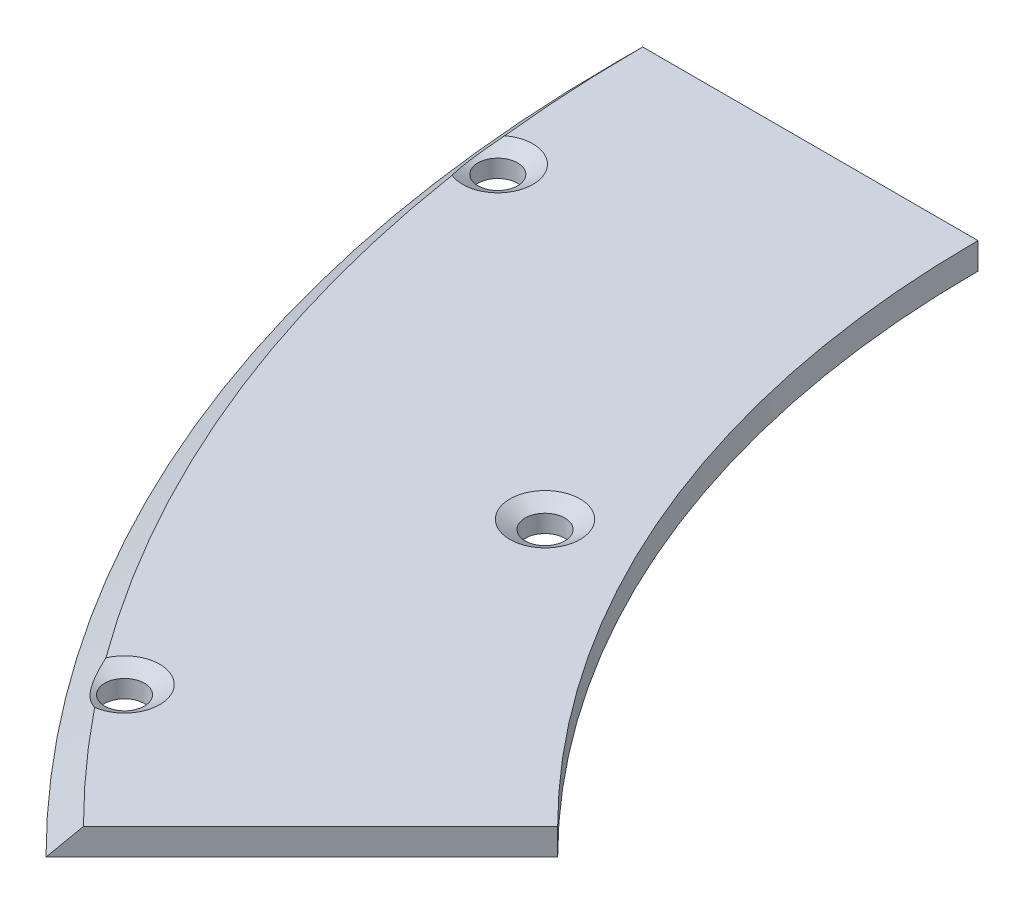
ISO-10303-21;
HEADER;
FILE_DESCRIPTION(('STEP AP214'),'2;1');
FILE_NAME('part.step','',(''),(''),'','','');
FILE_SCHEMA(('AUTOMOTIVE_DESIGN { 1 0 10303 214 1 1 1 1 }'));
ENDSEC;
DATA;
#1=APPLICATION_CONTEXT('core data for automotive mechanical design processes');
#2=APPLICATION_PROTOCOL_DEFINITION('international standard','automotive_design',2000,#1);
#3=PRODUCT_CONTEXT('',#1,'mechanical');
#4=PRODUCT('Part','Part','',(#3));
#5=PRODUCT_RELATED_PRODUCT_CATEGORY('part','',(#4));
#6=PRODUCT_DEFINITION_FORMATION('','',#4);
#7=PRODUCT_DEFINITION_CONTEXT('part definition',#1,'design');
#8=PRODUCT_DEFINITION('design','',#6,#7);
#9=PRODUCT_DEFINITION_SHAPE('','',#8);
#10=(LENGTH_UNIT() NAMED_UNIT(*) SI_UNIT(.MILLI.,.METRE.));
#11=(NAMED_UNIT(*) PLANE_ANGLE_UNIT() SI_UNIT($,.RADIAN.));
#12=(NAMED_UNIT(*) SI_UNIT($,.STERADIAN.) SOLID_ANGLE_UNIT());
#13=UNCERTAINTY_MEASURE_WITH_UNIT(LENGTH_MEASURE(1.E-05),#10,'distance_accuracy_value','');
#14=(GEOMETRIC_REPRESENTATION_CONTEXT(3) GLOBAL_UNCERTAINTY_ASSIGNED_CONTEXT((#13)) GLOBAL_UNIT_ASSIGNED_CONTEXT((#10,
#11,#12)) REPRESENTATION_CONTEXT('',''));
#15=CARTESIAN_POINT('',(0.,0.,0.));
#16=DIRECTION('',(0.,0.,1.));
#17=DIRECTION('',(1.,0.,0.));
#18=AXIS2_PLACEMENT_3D('',#15,#16,#17);
#19=CARTESIAN_POINT('',(0.,3.,0.));
#20=DIRECTION('',(0.,1.,0.));
#21=DIRECTION('',(0.,0.,1.));
#22=AXIS2_PLACEMENT_3D('',#19,#20,#21);
#23=PLANE('',#22);
#24=CARTESIAN_POINT('',(-112.185705103319,3.,51.8808015596447));
#25=DIRECTION('',(0.,1.,0.));
#26=DIRECTION('',(0.,0.,1.));
#27=AXIS2_PLACEMENT_3D('',#24,#25,#26);
#28=CIRCLE('',#27,3.98205080756883);
#29=CARTESIAN_POINT('',(-112.185705103319,3.,55.8628523672136));
#30=VERTEX_POINT('',#29);
#31=EDGE_CURVE('E11',#30,#30,#28,.F.);
#32=ORIENTED_EDGE('',*,*,#31,.T.);
#33=EDGE_LOOP('',(#32));
#34=FACE_BOUND('',#33,.T.);
#35=DIRECTION('',(-1.,0.,0.));
#36=VECTOR('',#35,1.);
#37=CARTESIAN_POINT('',(-115.,3.,0.));
#38=LINE('',#37,#36);
#39=CARTESIAN_POINT('',(-115.,3.,0.));
#40=VERTEX_POINT('',#39);
#41=CARTESIAN_POINT('',(-153.,3.,0.));
#42=VERTEX_POINT('',#41);
#43=EDGE_CURVE('E84',#40,#42,#38,.T.);
#44=ORIENTED_EDGE('',*,*,#43,.T.);
#45=CARTESIAN_POINT('',(0.,3.,0.));
#46=DIRECTION('',(0.,1.,0.));
#47=DIRECTION('',(0.,0.,1.));
#48=AXIS2_PLACEMENT_3D('',#45,#46,#47);
#49=CIRCLE('',#48,153.);
#50=CARTESIAN_POINT('',(-152.10452532569,3.,16.5291674154085));
#51=VERTEX_POINT('',#50);
#52=EDGE_CURVE('E123',#42,#51,#49,.T.);
#53=ORIENTED_EDGE('',*,*,#52,.T.);
#54=CARTESIAN_POINT('',(-149.708174067445,3.,19.7094550252278));
#55=DIRECTION('',(0.,1.,0.));
#56=DIRECTION('',(0.,0.,1.));
#57=AXIS2_PLACEMENT_3D('',#54,#55,#56);
#58=CIRCLE('',#57,3.98205080756889);
#59=CARTESIAN_POINT('',(-151.199752634319,3.,23.4015983069685));
#60=VERTEX_POINT('',#59);
#61=EDGE_CURVE('E108',#51,#60,#58,.F.);
#62=ORIENTED_EDGE('',*,*,#61,.T.);
#63=CARTESIAN_POINT('',(0.,3.,0.));
#64=DIRECTION('',(0.,1.,0.));
#65=DIRECTION('',(0.,0.,1.));
#66=AXIS2_PLACEMENT_3D('',#63,#64,#65);
#67=CIRCLE('',#66,153.);
#68=CARTESIAN_POINT('',(-123.461799254917,3.,90.3669415479939));
#69=VERTEX_POINT('',#68);
#70=EDGE_CURVE('E121',#60,#69,#67,.T.);
#71=ORIENTED_EDGE('',*,*,#70,.T.);
#72=CARTESIAN_POINT('',(-119.796354383977,3.,91.9229757803162));
#73=DIRECTION('',(0.,1.,0.));
#74=DIRECTION('',(0.,0.,1.));
#75=AXIS2_PLACEMENT_3D('',#72,#73,#74);
#76=CIRCLE('',#75,3.98205080756889);
#77=CARTESIAN_POINT('',(-119.24202767376,3.,95.8662549401525));
#78=VERTEX_POINT('',#77);
#79=EDGE_CURVE('E115',#69,#78,#76,.F.);
#80=ORIENTED_EDGE('',*,*,#79,.T.);
#81=CARTESIAN_POINT('',(0.,3.,0.));
#82=DIRECTION('',(0.,1.,0.));
#83=DIRECTION('',(0.,0.,1.));
#84=AXIS2_PLACEMENT_3D('',#81,#82,#83);
#85=CIRCLE('',#84,153.);
#86=CARTESIAN_POINT('',(-108.187337521542,3.00000000000002,108.187337521541));
#87=VERTEX_POINT('',#86);
#88=EDGE_CURVE('E47',#78,#87,#85,.T.);
#89=ORIENTED_EDGE('',*,*,#88,.T.);
#90=DIRECTION('',(0.707106781186551,0.,-0.707106781186544));
#91=VECTOR('',#90,1.);
#92=CARTESIAN_POINT('',(-110.308657865102,3.,110.308657865101));
#93=LINE('',#92,#91);
#94=CARTESIAN_POINT('',(-81.3172798364534,3.,81.3172798364525));
#95=VERTEX_POINT('',#94);
#96=EDGE_CURVE('E92',#87,#95,#93,.T.);
#97=ORIENTED_EDGE('',*,*,#96,.T.);
#98=CARTESIAN_POINT('',(0.,3.,0.));
#99=DIRECTION('',(0.,-1.,0.));
#100=DIRECTION('',(0.,0.,1.));
#101=AXIS2_PLACEMENT_3D('',#98,#99,#100);
#102=CIRCLE('',#101,115.);
#103=EDGE_CURVE('E93',#95,#40,#102,.T.);
#104=ORIENTED_EDGE('',*,*,#103,.T.);
#105=EDGE_LOOP('',(#44,#53,#62,#71,#80,#89,#97,#104));
#106=FACE_BOUND('',#105,.T.);
#107=ADVANCED_FACE('F32',(#34,#106),#23,.T.);
#108=CARTESIAN_POINT('',(0.,0.,0.));
#109=DIRECTION('',(0.,1.,0.));
#110=DIRECTION('',(0.,0.,1.));
#111=AXIS2_PLACEMENT_3D('',#108,#109,#110);
#112=PLANE('',#111);
#113=CARTESIAN_POINT('',(-112.185705103319,0.,51.8808015596447));
#114=DIRECTION('',(0.,1.,0.));
#115=DIRECTION('',(0.,0.,1.));
#116=AXIS2_PLACEMENT_3D('',#113,#114,#115);
#117=CIRCLE('',#116,2.25);
#118=CARTESIAN_POINT('',(-112.185705103319,0.,54.1308015596447));
#119=VERTEX_POINT('',#118);
#120=EDGE_CURVE('E193',#119,#119,#117,.T.);
#121=ORIENTED_EDGE('',*,*,#120,.T.);
#122=EDGE_LOOP('',(#121));
#123=FACE_BOUND('',#122,.T.);
#124=CARTESIAN_POINT('',(-149.708174067445,0.,19.7094550252278));
#125=DIRECTION('',(0.,1.,0.));
#126=DIRECTION('',(0.,0.,1.));
#127=AXIS2_PLACEMENT_3D('',#124,#125,#126);
#128=CIRCLE('',#127,2.25000000000001);
#129=CARTESIAN_POINT('',(-149.708174067445,0.,21.9594550252278));
#130=VERTEX_POINT('',#129);
#131=EDGE_CURVE('E192',#130,#130,#128,.T.);
#132=ORIENTED_EDGE('',*,*,#131,.T.);
#133=EDGE_LOOP('',(#132));
#134=FACE_BOUND('',#133,.T.);
#135=CARTESIAN_POINT('',(0.,0.,0.));
#136=DIRECTION('',(0.,-1.,0.));
#137=DIRECTION('',(0.,0.,1.));
#138=AXIS2_PLACEMENT_3D('',#135,#136,#137);
#139=CIRCLE('',#138,115.);
#140=CARTESIAN_POINT('',(-81.3172798364534,0.,81.3172798364525));
#141=VERTEX_POINT('',#140);
#142=CARTESIAN_POINT('',(-115.,0.,0.));
#143=VERTEX_POINT('',#142);
#144=EDGE_CURVE('E103',#141,#143,#139,.T.);
#145=ORIENTED_EDGE('',*,*,#144,.F.);
#146=DIRECTION('',(0.707106781186551,0.,-0.707106781186544));
#147=VECTOR('',#146,1.);
#148=CARTESIAN_POINT('',(-110.308657865102,0.,110.308657865101));
#149=LINE('',#148,#147);
#150=CARTESIAN_POINT('',(-110.308657865102,0.,110.308657865101));
#151=VERTEX_POINT('',#150);
#152=EDGE_CURVE('E99',#151,#141,#149,.T.);
#153=ORIENTED_EDGE('',*,*,#152,.F.);
#154=CARTESIAN_POINT('',(0.,0.,0.));
#155=DIRECTION('',(0.,1.,0.));
#156=DIRECTION('',(0.,0.,1.));
#157=AXIS2_PLACEMENT_3D('',#154,#155,#156);
#158=CIRCLE('',#157,156.);
#159=CARTESIAN_POINT('',(-156.,0.,0.));
#160=VERTEX_POINT('',#159);
#161=EDGE_CURVE('E204',#160,#151,#158,.T.);
#162=ORIENTED_EDGE('',*,*,#161,.F.);
#163=DIRECTION('',(-1.,0.,0.));
#164=VECTOR('',#163,1.);
#165=CARTESIAN_POINT('',(-115.,0.,0.));
#166=LINE('',#165,#164);
#167=EDGE_CURVE('E202',#143,#160,#166,.T.);
#168=ORIENTED_EDGE('',*,*,#167,.F.);
#169=EDGE_LOOP('',(#145,#153,#162,#168));
#170=FACE_BOUND('',#169,.T.);
#171=CARTESIAN_POINT('',(-119.796354383977,0.,91.9229757803162));
#172=DIRECTION('',(0.,1.,0.));
#173=DIRECTION('',(0.,0.,1.));
#174=AXIS2_PLACEMENT_3D('',#171,#172,#173);
#175=CIRCLE('',#174,2.25);
#176=CARTESIAN_POINT('',(-119.796354383977,0.,94.1729757803162));
#177=VERTEX_POINT('',#176);
#178=EDGE_CURVE('E190',#177,#177,#175,.T.);
#179=ORIENTED_EDGE('',*,*,#178,.T.);
#180=EDGE_LOOP('',(#179));
#181=FACE_BOUND('',#180,.T.);
#182=ADVANCED_FACE('F153',(#123,#134,#170,#181),#112,.F.);
#183=CARTESIAN_POINT('',(0.,3.,0.));
#184=DIRECTION('',(0.,-1.,0.));
#185=DIRECTION('',(0.,0.,-1.));
#186=AXIS2_PLACEMENT_3D('',#183,#184,#185);
#187=CYLINDRICAL_SURFACE('',#186,115.);
#188=ORIENTED_EDGE('',*,*,#144,.T.);
#189=DIRECTION('',(0.,-1.,0.));
#190=VECTOR('',#189,1.);
#191=CARTESIAN_POINT('',(-115.,3.,0.));
#192=LINE('',#191,#190);
#193=EDGE_CURVE('E88',#40,#143,#192,.T.);
#194=ORIENTED_EDGE('',*,*,#193,.F.);
#195=ORIENTED_EDGE('',*,*,#103,.F.);
#196=DIRECTION('',(0.,-1.,0.));
#197=VECTOR('',#196,1.);
#198=CARTESIAN_POINT('',(-81.3172798364534,3.,81.3172798364525));
#199=LINE('',#198,#197);
#200=EDGE_CURVE('E105',#95,#141,#199,.T.);
#201=ORIENTED_EDGE('',*,*,#200,.T.);
#202=EDGE_LOOP('',(#188,#194,#195,#201));
#203=FACE_BOUND('',#202,.T.);
#204=ADVANCED_FACE('F101',(#203),#187,.F.);
#205=CARTESIAN_POINT('',(-115.,3.,0.));
#206=DIRECTION('',(0.,0.,1.));
#207=DIRECTION('',(1.,0.,0.));
#208=AXIS2_PLACEMENT_3D('',#205,#206,#207);
#209=PLANE('',#208);
#210=ORIENTED_EDGE('',*,*,#167,.T.);
#211=DIRECTION('',(-0.707106781186544,-0.707106781186551,0.));
#212=VECTOR('',#211,1.);
#213=CARTESIAN_POINT('',(0.,156.000000000001,0.));
#214=LINE('',#213,#212);
#215=EDGE_CURVE('E55',#160,#42,#214,.F.);
#216=ORIENTED_EDGE('',*,*,#215,.T.);
#217=ORIENTED_EDGE('',*,*,#43,.F.);
#218=ORIENTED_EDGE('',*,*,#193,.T.);
#219=EDGE_LOOP('',(#210,#216,#217,#218));
#220=FACE_BOUND('',#219,.T.);
#221=ADVANCED_FACE('F86',(#220),#209,.F.);
#222=CARTESIAN_POINT('',(-110.308657865102,3.,110.308657865101));
#223=DIRECTION('',(-0.707106781186544,0.,-0.707106781186551));
#224=DIRECTION('',(-0.707106781186551,0.,0.707106781186544));
#225=AXIS2_PLACEMENT_3D('',#222,#223,#224);
#226=PLANE('',#225);
#227=ORIENTED_EDGE('',*,*,#96,.F.);
#228=DIRECTION('',(0.5,0.707106781186551,-0.499999999999995));
#229=VECTOR('',#228,1.);
#230=CARTESIAN_POINT('',(0.,156.000000000001,0.));
#231=LINE('',#230,#229);
#232=EDGE_CURVE('E208',#87,#151,#231,.F.);
#233=ORIENTED_EDGE('',*,*,#232,.T.);
#234=ORIENTED_EDGE('',*,*,#152,.T.);
#235=ORIENTED_EDGE('',*,*,#200,.F.);
#236=EDGE_LOOP('',(#227,#233,#234,#235));
#237=FACE_BOUND('',#236,.T.);
#238=ADVANCED_FACE('F165',(#237),#226,.F.);
#239=CARTESIAN_POINT('',(-149.708174067445,3.,19.7094550252278));
#240=DIRECTION('',(0.,-1.,0.));
#241=DIRECTION('',(0.,0.,-1.));
#242=AXIS2_PLACEMENT_3D('',#239,#240,#241);
#243=CYLINDRICAL_SURFACE('',#242,2.25000000000001);
#244=CARTESIAN_POINT('',(-149.708174067445,1.99999999999999,19.7094550252278));
#245=DIRECTION('',(0.,1.,0.));
#246=DIRECTION('',(0.,0.,1.));
#247=AXIS2_PLACEMENT_3D('',#244,#245,#246);
#248=CIRCLE('',#247,2.25000000000001);
#249=CARTESIAN_POINT('',(-149.708174067445,1.99999999999999,21.9594550252278));
#250=VERTEX_POINT('',#249);
#251=EDGE_CURVE('E117',#250,#250,#248,.T.);
#252=ORIENTED_EDGE('',*,*,#251,.T.);
#253=EDGE_LOOP('',(#252));
#254=FACE_BOUND('',#253,.T.);
#255=ORIENTED_EDGE('',*,*,#131,.F.);
#256=EDGE_LOOP('',(#255));
#257=FACE_BOUND('',#256,.T.);
#258=ADVANCED_FACE('F162',(#254,#257),#243,.F.);
#259=CARTESIAN_POINT('',(-119.796354383977,3.,91.9229757803162));
#260=DIRECTION('',(0.,-1.,0.));
#261=DIRECTION('',(0.,0.,-1.));
#262=AXIS2_PLACEMENT_3D('',#259,#260,#261);
#263=CYLINDRICAL_SURFACE('',#262,2.25);
#264=CARTESIAN_POINT('',(-119.796354383977,1.99999999999998,91.9229757803162));
#265=DIRECTION('',(0.,1.,0.));
#266=DIRECTION('',(0.,0.,1.));
#267=AXIS2_PLACEMENT_3D('',#264,#265,#266);
#268=CIRCLE('',#267,2.25);
#269=CARTESIAN_POINT('',(-119.796354383977,1.99999999999998,94.1729757803162));
#270=VERTEX_POINT('',#269);
#271=EDGE_CURVE('E104',#270,#270,#268,.T.);
#272=ORIENTED_EDGE('',*,*,#271,.T.);
#273=EDGE_LOOP('',(#272));
#274=FACE_BOUND('',#273,.T.);
#275=ORIENTED_EDGE('',*,*,#178,.F.);
#276=EDGE_LOOP('',(#275));
#277=FACE_BOUND('',#276,.T.);
#278=ADVANCED_FACE('F175',(#274,#277),#263,.F.);
#279=CARTESIAN_POINT('',(-119.796354383977,1.99999999999998,91.9229757803162));
#280=DIRECTION('',(0.,1.,0.));
#281=DIRECTION('',(0.,0.,1.));
#282=AXIS2_PLACEMENT_3D('',#279,#280,#281);
#283=CONICAL_SURFACE('',#282,2.25,1.04719755119659);
#284=ORIENTED_EDGE('',*,*,#79,.F.);
#285=CARTESIAN_POINT('',(-123.461799254917,3.,90.3669415479939));
#286=CARTESIAN_POINT('',(-123.43086619996,2.95799230259586,90.4803258383819));
#287=CARTESIAN_POINT('',(-123.398475590095,2.91703727255009,90.5937200034644));
#288=CARTESIAN_POINT('',(-123.330378336554,2.83759267972244,90.8204451428695));
#289=CARTESIAN_POINT('',(-123.294669961324,2.79910442226574,90.9337760527869));
#290=CARTESIAN_POINT('',(-123.219315966755,2.7247497940451,91.160931933753));
#291=CARTESIAN_POINT('',(-123.179645537626,2.68890274778597,91.27475511774));
#292=CARTESIAN_POINT('',(-123.0961652689,2.62059204780658,91.5018598911807));
#293=CARTESIAN_POINT('',(-123.052356031556,2.58812790326824,91.6151415569203));
#294=CARTESIAN_POINT('',(-122.915354593616,2.4974489120459,91.9505457026514));
#295=CARTESIAN_POINT('',(-122.815492862829,2.44481376842435,92.1716201934287));
#296=CARTESIAN_POINT('',(-122.650347935653,2.38048229355576,92.4979067433283));
#297=CARTESIAN_POINT('',(-122.592815599228,2.36148876983367,92.6056609376342));
#298=CARTESIAN_POINT('',(-122.472396470722,2.32882183957727,92.8189518473314));
#299=CARTESIAN_POINT('',(-122.409510797251,2.31514732491506,92.9244890202638));
#300=CARTESIAN_POINT('',(-122.258309230117,2.29024095731079,93.1644857721));
#301=CARTESIAN_POINT('',(-122.168081534219,2.28102157288939,93.2979642511846));
#302=CARTESIAN_POINT('',(-121.978702147758,2.27287019398707,93.5588191029214));
#303=CARTESIAN_POINT('',(-121.879548020027,2.27394101751394,93.6861937944328));
#304=CARTESIAN_POINT('',(-121.673144789091,2.28631761644576,93.9338488360516));
#305=CARTESIAN_POINT('',(-121.565888957656,2.2976319864059,94.0541231384998));
#306=CARTESIAN_POINT('',(-121.344636221354,2.32987678191294,94.2868578593325));
#307=CARTESIAN_POINT('',(-121.230639938235,2.35080632174493,94.3993189963394));
#308=CARTESIAN_POINT('',(-120.969225238508,2.40732778672588,94.6424512265605));
#309=CARTESIAN_POINT('',(-120.820351906745,2.44523318858431,94.7710145933979));
#310=CARTESIAN_POINT('',(-120.516516131815,2.53204544462214,95.0169396106473));
#311=CARTESIAN_POINT('',(-120.361546886333,2.58096489411536,95.1342882156195));
#312=CARTESIAN_POINT('',(-120.047149647202,2.68771282172956,95.3591833297421));
#313=CARTESIAN_POINT('',(-119.887713007253,2.74555971617013,95.4667088279377));
#314=CARTESIAN_POINT('',(-119.646684890622,2.83746967481599,95.6213345973857));
#315=CARTESIAN_POINT('',(-119.56614860375,2.86891343056184,95.6716976042384));
#316=CARTESIAN_POINT('',(-119.40449955394,2.93334376170601,95.7704268606982));
#317=CARTESIAN_POINT('',(-119.323386933139,2.96632996718199,95.818793583884));
#318=CARTESIAN_POINT('',(-119.24202767376,3.00000000000001,95.8662549401525));
#319=B_SPLINE_CURVE_WITH_KNOTS('',3,(#285,#286,#287,#288,#289,#290,#291,#292,#293,#294,#295,
#296,#297,#298,#299,#300,#301,#302,#303,#304,#305,#306,#307,#308,#309,#310,#311,#312,#313,#314,
#315,#316,#317,#318),.UNSPECIFIED.,.F.,.F.,(4,2,2,2,2,2,2,2,2,2,2,2,2,2,2,2,4),(0.,
0.374438735025378,0.74907400062623,1.1262229191616,1.50331704154201,2.24631772566529,
2.61696943822891,2.98754389020266,3.47098487763635,3.95455826076947,4.43853774872642,
4.92247266316829,5.52255675110642,6.12333059340512,6.72536075252574,7.02550311873682,
7.32557386799686),.UNSPECIFIED.);
#320=EDGE_CURVE('E131',#69,#78,#319,.T.);
#321=ORIENTED_EDGE('',*,*,#320,.T.);
#322=EDGE_LOOP('',(#284,#321));
#323=FACE_BOUND('',#322,.T.);
#324=ORIENTED_EDGE('',*,*,#271,.F.);
#325=EDGE_LOOP('',(#324));
#326=FACE_BOUND('',#325,.T.);
#327=ADVANCED_FACE('F172',(#323,#326),#283,.F.);
#328=CARTESIAN_POINT('',(-149.708174067445,1.99999999999999,19.7094550252278));
#329=DIRECTION('',(0.,1.,0.));
#330=DIRECTION('',(0.,0.,1.));
#331=AXIS2_PLACEMENT_3D('',#328,#329,#330);
#332=CONICAL_SURFACE('',#331,2.25000000000001,1.04719755119659);
#333=ORIENTED_EDGE('',*,*,#61,.F.);
#334=CARTESIAN_POINT('',(-152.10452532569,3.,16.5291674154085));
#335=CARTESIAN_POINT('',(-152.134428659474,2.95799230259587,16.642827618753));
#336=CARTESIAN_POINT('',(-152.163074651029,2.9170372725501,16.7572251512879));
#337=CARTESIAN_POINT('',(-152.217463269237,2.83759267972244,16.9876235084599));
#338=CARTESIAN_POINT('',(-152.243204364118,2.79910442226575,17.1036251430974));
#339=CARTESIAN_POINT('',(-152.291523831027,2.7247497940451,17.3380249039178));
#340=CARTESIAN_POINT('',(-152.314079823617,2.68890274778597,17.4564338873543));
#341=CARTESIAN_POINT('',(-152.355336176905,2.62059204780659,17.694852524838));
#342=CARTESIAN_POINT('',(-152.374037097314,2.58812790326825,17.8148619438234));
#343=CARTESIAN_POINT('',(-152.42309244457,2.49744891204591,18.1738311735309));
#344=CARTESIAN_POINT('',(-152.44714689423,2.44481376842435,18.4152181640665));
#345=CARTESIAN_POINT('',(-152.467270466939,2.38048229355576,18.7803630687808));
#346=CARTESIAN_POINT('',(-152.471323099209,2.36148876983367,18.9024471066265));
#347=CARTESIAN_POINT('',(-152.47368252967,2.32882183957728,19.1473720170734));
#348=CARTESIAN_POINT('',(-152.471990525377,2.31514732491507,19.2702127266117));
#349=CARTESIAN_POINT('',(-152.461044503065,2.2902409573108,19.553656794095));
#350=CARTESIAN_POINT('',(-152.449644265834,2.2810215728894,19.7143663957898));
#351=CARTESIAN_POINT('',(-152.416064332075,2.27287019398708,20.0349630173245));
#352=CARTESIAN_POINT('',(-152.393881684325,2.27394101751394,20.194849799838));
#353=CARTESIAN_POINT('',(-152.33895876372,2.28631761644576,20.5125269727236));
#354=CARTESIAN_POINT('',(-152.306209640218,2.29763198640591,20.6703154897836));
#355=CARTESIAN_POINT('',(-152.23096651034,2.32987678191295,20.9824960385184));
#356=CARTESIAN_POINT('',(-152.188473401726,2.35080632174494,21.136888381664));
#357=CARTESIAN_POINT('',(-152.083647745949,2.40732778672588,21.4781544193782));
#358=CARTESIAN_POINT('',(-152.019001342116,2.4452331885843,21.6639302269364));
#359=CARTESIAN_POINT('',(-151.878834351073,2.53204544462213,22.0288254267656));
#360=CARTESIAN_POINT('',(-151.803301350166,2.58096489411536,22.2079369225115));
#361=CARTESIAN_POINT('',(-151.64347291126,2.68771282172957,22.5599004240943));
#362=CARTESIAN_POINT('',(-151.559159479868,2.74555971617012,22.7327385570603));
#363=CARTESIAN_POINT('',(-151.427735892563,2.83746967481598,22.9871624597977));
#364=CARTESIAN_POINT('',(-151.383170925632,2.86891343056183,23.0710462465791));
#365=CARTESIAN_POINT('',(-151.292543370228,2.933343761706,23.2373728156753));
#366=CARTESIAN_POINT('',(-151.246481141641,2.96632996718198,23.3198159370521));
#367=CARTESIAN_POINT('',(-151.199752634319,2.99999999999999,23.4015983069685));
#368=B_SPLINE_CURVE_WITH_KNOTS('',3,(#334,#335,#336,#337,#338,#339,#340,#341,#342,#343,#344,
#345,#346,#347,#348,#349,#350,#351,#352,#353,#354,#355,#356,#357,#358,#359,#360,#361,#362,#363,
#364,#365,#366,#367),.UNSPECIFIED.,.F.,.F.,(4,2,2,2,2,2,2,2,2,2,2,2,2,2,2,2,4),(0.,
0.374438735025374,0.749074000626217,1.12622291916156,1.50331704154197,2.24631772566528,
2.61696943822888,2.98754389020262,3.47098487763631,3.95455826076944,4.43853774872638,
4.92247266316825,5.52255675110634,6.12333059340507,6.7253607525257,7.02550311873677,
7.32557386799681),.UNSPECIFIED.);
#369=EDGE_CURVE('E125',#51,#60,#368,.T.);
#370=ORIENTED_EDGE('',*,*,#369,.T.);
#371=EDGE_LOOP('',(#333,#370));
#372=FACE_BOUND('',#371,.T.);
#373=ORIENTED_EDGE('',*,*,#251,.F.);
#374=EDGE_LOOP('',(#373));
#375=FACE_BOUND('',#374,.T.);
#376=ADVANCED_FACE('F137',(#372,#375),#332,.F.);
#377=CARTESIAN_POINT('',(-112.185705103319,0.,51.8808015596447));
#378=DIRECTION('',(0.,1.,0.));
#379=DIRECTION('',(0.,0.,1.));
#380=AXIS2_PLACEMENT_3D('',#377,#378,#379);
#381=CYLINDRICAL_SURFACE('',#380,2.25);
#382=CARTESIAN_POINT('',(-112.185705103319,2.00000000000002,51.8808015596447));
#383=DIRECTION('',(0.,1.,0.));
#384=DIRECTION('',(0.,0.,1.));
#385=AXIS2_PLACEMENT_3D('',#382,#383,#384);
#386=CIRCLE('',#385,2.25);
#387=CARTESIAN_POINT('',(-112.185705103319,2.00000000000002,54.1308015596447));
#388=VERTEX_POINT('',#387);
#389=EDGE_CURVE('E40',#388,#388,#386,.T.);
#390=ORIENTED_EDGE('',*,*,#389,.T.);
#391=EDGE_LOOP('',(#390));
#392=FACE_BOUND('',#391,.T.);
#393=ORIENTED_EDGE('',*,*,#120,.F.);
#394=EDGE_LOOP('',(#393));
#395=FACE_BOUND('',#394,.T.);
#396=ADVANCED_FACE('F142',(#392,#395),#381,.F.);
#397=CARTESIAN_POINT('',(0.,3.,0.));
#398=DIRECTION('',(0.,-1.,0.));
#399=DIRECTION('',(0.,0.,-1.));
#400=AXIS2_PLACEMENT_3D('',#397,#398,#399);
#401=CONICAL_SURFACE('',#400,153.,0.785398163397444);
#402=ORIENTED_EDGE('',*,*,#215,.F.);
#403=ORIENTED_EDGE('',*,*,#161,.T.);
#404=ORIENTED_EDGE('',*,*,#232,.F.);
#405=ORIENTED_EDGE('',*,*,#88,.F.);
#406=ORIENTED_EDGE('',*,*,#320,.F.);
#407=ORIENTED_EDGE('',*,*,#70,.F.);
#408=ORIENTED_EDGE('',*,*,#369,.F.);
#409=ORIENTED_EDGE('',*,*,#52,.F.);
#410=EDGE_LOOP('',(#402,#403,#404,#405,#406,#407,#408,#409));
#411=FACE_BOUND('',#410,.T.);
#412=ADVANCED_FACE('F139',(#411),#401,.T.);
#413=CARTESIAN_POINT('',(-112.185705103319,2.00000000000002,51.8808015596447));
#414=DIRECTION('',(0.,1.,0.));
#415=DIRECTION('',(0.,0.,1.));
#416=AXIS2_PLACEMENT_3D('',#413,#414,#415);
#417=CONICAL_SURFACE('',#416,2.25,1.0471975511966);
#418=ORIENTED_EDGE('',*,*,#31,.F.);
#419=EDGE_LOOP('',(#418));
#420=FACE_BOUND('',#419,.T.);
#421=ORIENTED_EDGE('',*,*,#389,.F.);
#422=EDGE_LOOP('',(#421));
#423=FACE_BOUND('',#422,.T.);
#424=ADVANCED_FACE('F34',(#420,#423),#417,.F.);
#425=CLOSED_SHELL('',(#107,#182,#204,#221,#238,#258,#278,#327,#376,#396,#412,#424));
#426=MANIFOLD_SOLID_BREP('B2',#425);
#427=ADVANCED_BREP_SHAPE_REPRESENTATION('',(#18,#426),#14);
#428=SHAPE_DEFINITION_REPRESENTATION(#9,#427);
ENDSEC;
END-ISO-10303-21;
